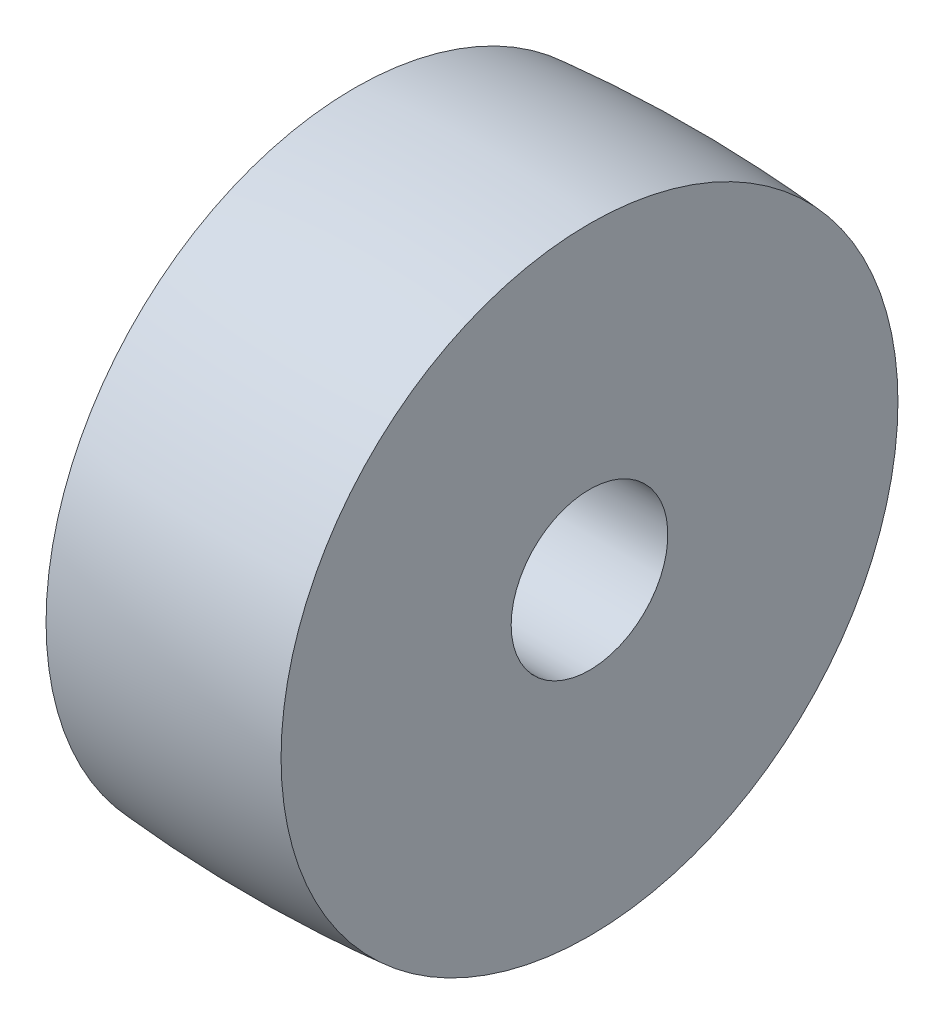
ISO-10303-21;
HEADER;
FILE_DESCRIPTION(('STEP AP214'),'2;1');
FILE_NAME('part.step','',(''),(''),'','','');
FILE_SCHEMA(('AUTOMOTIVE_DESIGN { 1 0 10303 214 1 1 1 1 }'));
ENDSEC;
DATA;
#1=APPLICATION_CONTEXT('core data for automotive mechanical design processes');
#2=APPLICATION_PROTOCOL_DEFINITION('international standard','automotive_design',2000,#1);
#3=PRODUCT_CONTEXT('',#1,'mechanical');
#4=PRODUCT('Part','Part','',(#3));
#5=PRODUCT_RELATED_PRODUCT_CATEGORY('part','',(#4));
#6=PRODUCT_DEFINITION_FORMATION('','',#4);
#7=PRODUCT_DEFINITION_CONTEXT('part definition',#1,'design');
#8=PRODUCT_DEFINITION('design','',#6,#7);
#9=PRODUCT_DEFINITION_SHAPE('','',#8);
#10=(LENGTH_UNIT() NAMED_UNIT(*) SI_UNIT(.MILLI.,.METRE.));
#11=(NAMED_UNIT(*) PLANE_ANGLE_UNIT() SI_UNIT($,.RADIAN.));
#12=(NAMED_UNIT(*) SI_UNIT($,.STERADIAN.) SOLID_ANGLE_UNIT());
#13=UNCERTAINTY_MEASURE_WITH_UNIT(LENGTH_MEASURE(1.E-05),#10,'distance_accuracy_value','');
#14=(GEOMETRIC_REPRESENTATION_CONTEXT(3) GLOBAL_UNCERTAINTY_ASSIGNED_CONTEXT((#13)) GLOBAL_UNIT_ASSIGNED_CONTEXT((#10,
#11,#12)) REPRESENTATION_CONTEXT('',''));
#15=CARTESIAN_POINT('',(0.,0.,0.));
#16=DIRECTION('',(0.,0.,1.));
#17=DIRECTION('',(1.,0.,0.));
#18=AXIS2_PLACEMENT_3D('',#15,#16,#17);
#19=CARTESIAN_POINT('',(38.1,25.4,0.));
#20=DIRECTION('',(-1.,0.,0.));
#21=DIRECTION('',(0.,0.,1.));
#22=AXIS2_PLACEMENT_3D('',#19,#20,#21);
#23=PLANE('',#22);
#24=CARTESIAN_POINT('',(38.1,0.,0.));
#25=DIRECTION('',(-1.,0.,0.));
#26=DIRECTION('',(0.,0.,1.));
#27=AXIS2_PLACEMENT_3D('',#24,#25,#26);
#28=CIRCLE('',#27,100.0125);
#29=CARTESIAN_POINT('',(38.1,0.,100.0125));
#30=VERTEX_POINT('',#29);
#31=EDGE_CURVE('E45',#30,#30,#28,.T.);
#32=ORIENTED_EDGE('',*,*,#31,.F.);
#33=EDGE_LOOP('',(#32));
#34=FACE_BOUND('',#33,.T.);
#35=CARTESIAN_POINT('',(38.1,0.,0.));
#36=DIRECTION('',(-1.,0.,0.));
#37=DIRECTION('',(0.,0.,1.));
#38=AXIS2_PLACEMENT_3D('',#35,#36,#37);
#39=CIRCLE('',#38,25.4);
#40=CARTESIAN_POINT('',(38.1,0.,25.4));
#41=VERTEX_POINT('',#40);
#42=EDGE_CURVE('E10',#41,#41,#39,.T.);
#43=ORIENTED_EDGE('',*,*,#42,.T.);
#44=EDGE_LOOP('',(#43));
#45=FACE_BOUND('',#44,.T.);
#46=ADVANCED_FACE('F31',(#34,#45),#23,.F.);
#47=CARTESIAN_POINT('',(-41.91,0.,0.));
#48=DIRECTION('',(-1.,0.,0.));
#49=DIRECTION('',(0.,0.,1.));
#50=AXIS2_PLACEMENT_3D('',#47,#48,#49);
#51=CYLINDRICAL_SURFACE('',#50,25.4);
#52=ORIENTED_EDGE('',*,*,#42,.F.);
#53=EDGE_LOOP('',(#52));
#54=FACE_BOUND('',#53,.T.);
#55=CARTESIAN_POINT('',(-38.1,0.,0.));
#56=DIRECTION('',(-1.,0.,0.));
#57=DIRECTION('',(0.,0.,1.));
#58=AXIS2_PLACEMENT_3D('',#55,#56,#57);
#59=CIRCLE('',#58,25.4);
#60=CARTESIAN_POINT('',(-38.1,0.,25.4));
#61=VERTEX_POINT('',#60);
#62=EDGE_CURVE('E37',#61,#61,#59,.T.);
#63=ORIENTED_EDGE('',*,*,#62,.T.);
#64=EDGE_LOOP('',(#63));
#65=FACE_BOUND('',#64,.T.);
#66=ADVANCED_FACE('F54',(#54,#65),#51,.F.);
#67=CARTESIAN_POINT('',(-38.1,25.4,0.));
#68=DIRECTION('',(1.,0.,0.));
#69=DIRECTION('',(0.,0.,-1.));
#70=AXIS2_PLACEMENT_3D('',#67,#68,#69);
#71=PLANE('',#70);
#72=ORIENTED_EDGE('',*,*,#62,.F.);
#73=EDGE_LOOP('',(#72));
#74=FACE_BOUND('',#73,.T.);
#75=CARTESIAN_POINT('',(-38.1,0.,0.));
#76=DIRECTION('',(-1.,0.,0.));
#77=DIRECTION('',(0.,0.,1.));
#78=AXIS2_PLACEMENT_3D('',#75,#76,#77);
#79=CIRCLE('',#78,100.0125);
#80=CARTESIAN_POINT('',(-38.1,0.,100.0125));
#81=VERTEX_POINT('',#80);
#82=EDGE_CURVE('E41',#81,#81,#79,.T.);
#83=ORIENTED_EDGE('',*,*,#82,.T.);
#84=EDGE_LOOP('',(#83));
#85=FACE_BOUND('',#84,.T.);
#86=ADVANCED_FACE('F58',(#74,#85),#71,.F.);
#87=CARTESIAN_POINT('',(0.,0.,0.));
#88=DIRECTION('',(-1.,0.,0.));
#89=DIRECTION('',(0.,0.,1.));
#90=AXIS2_PLACEMENT_3D('',#87,#88,#89);
#91=DEGENERATE_TOROIDAL_SURFACE('',#90,356.393749999998,457.993749999998,.F.);
#92=ORIENTED_EDGE('',*,*,#82,.F.);
#93=EDGE_LOOP('',(#92));
#94=FACE_BOUND('',#93,.T.);
#95=ORIENTED_EDGE('',*,*,#31,.T.);
#96=EDGE_LOOP('',(#95));
#97=FACE_BOUND('',#96,.T.);
#98=ADVANCED_FACE('F51',(#94,#97),#91,.F.);
#99=CLOSED_SHELL('',(#46,#66,#86,#98));
#100=MANIFOLD_SOLID_BREP('B2',#99);
#101=ADVANCED_BREP_SHAPE_REPRESENTATION('',(#18,#100),#14);
#102=SHAPE_DEFINITION_REPRESENTATION(#9,#101);
ENDSEC;
END-ISO-10303-21;
